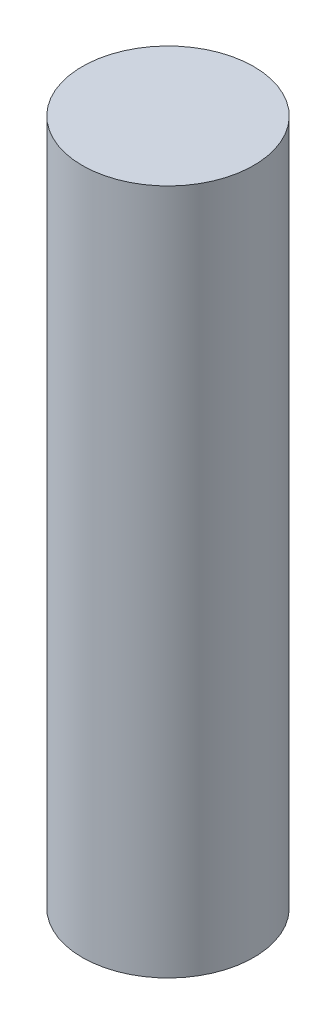
ISO-10303-21;
HEADER;
FILE_DESCRIPTION(('STEP AP214'),'2;1');
FILE_NAME('part.step','',(''),(''),'','','');
FILE_SCHEMA(('AUTOMOTIVE_DESIGN { 1 0 10303 214 1 1 1 1 }'));
ENDSEC;
DATA;
#1=APPLICATION_CONTEXT('core data for automotive mechanical design processes');
#2=APPLICATION_PROTOCOL_DEFINITION('international standard','automotive_design',2000,#1);
#3=PRODUCT_CONTEXT('',#1,'mechanical');
#4=PRODUCT('Part','Part','',(#3));
#5=PRODUCT_RELATED_PRODUCT_CATEGORY('part','',(#4));
#6=PRODUCT_DEFINITION_FORMATION('','',#4);
#7=PRODUCT_DEFINITION_CONTEXT('part definition',#1,'design');
#8=PRODUCT_DEFINITION('design','',#6,#7);
#9=PRODUCT_DEFINITION_SHAPE('','',#8);
#10=(LENGTH_UNIT() NAMED_UNIT(*) SI_UNIT(.MILLI.,.METRE.));
#11=(NAMED_UNIT(*) PLANE_ANGLE_UNIT() SI_UNIT($,.RADIAN.));
#12=(NAMED_UNIT(*) SI_UNIT($,.STERADIAN.) SOLID_ANGLE_UNIT());
#13=UNCERTAINTY_MEASURE_WITH_UNIT(LENGTH_MEASURE(1.E-05),#10,'distance_accuracy_value','');
#14=(GEOMETRIC_REPRESENTATION_CONTEXT(3) GLOBAL_UNCERTAINTY_ASSIGNED_CONTEXT((#13)) GLOBAL_UNIT_ASSIGNED_CONTEXT((#10,
#11,#12)) REPRESENTATION_CONTEXT('',''));
#15=CARTESIAN_POINT('',(0.,0.,0.));
#16=DIRECTION('',(0.,0.,1.));
#17=DIRECTION('',(1.,0.,0.));
#18=AXIS2_PLACEMENT_3D('',#15,#16,#17);
#19=CARTESIAN_POINT('',(0.,12.,0.));
#20=DIRECTION('',(0.,-1.,0.));
#21=DIRECTION('',(0.,0.,-1.));
#22=AXIS2_PLACEMENT_3D('',#19,#20,#21);
#23=CYLINDRICAL_SURFACE('',#22,1.5);
#24=CARTESIAN_POINT('',(0.,12.,0.));
#25=DIRECTION('',(0.,1.,0.));
#26=DIRECTION('',(0.,0.,1.));
#27=AXIS2_PLACEMENT_3D('',#24,#25,#26);
#28=CIRCLE('',#27,1.5);
#29=CARTESIAN_POINT('',(0.,12.,1.5));
#30=VERTEX_POINT('',#29);
#31=EDGE_CURVE('E10',#30,#30,#28,.T.);
#32=ORIENTED_EDGE('',*,*,#31,.F.);
#33=EDGE_LOOP('',(#32));
#34=FACE_BOUND('',#33,.T.);
#35=CARTESIAN_POINT('',(0.,0.,0.));
#36=DIRECTION('',(0.,1.,0.));
#37=DIRECTION('',(0.,0.,1.));
#38=AXIS2_PLACEMENT_3D('',#35,#36,#37);
#39=CIRCLE('',#38,1.5);
#40=CARTESIAN_POINT('',(0.,0.,1.5));
#41=VERTEX_POINT('',#40);
#42=EDGE_CURVE('E34',#41,#41,#39,.T.);
#43=ORIENTED_EDGE('',*,*,#42,.T.);
#44=EDGE_LOOP('',(#43));
#45=FACE_BOUND('',#44,.T.);
#46=ADVANCED_FACE('F31',(#34,#45),#23,.T.);
#47=CARTESIAN_POINT('',(0.,12.,0.));
#48=DIRECTION('',(0.,1.,0.));
#49=DIRECTION('',(0.,0.,1.));
#50=AXIS2_PLACEMENT_3D('',#47,#48,#49);
#51=PLANE('',#50);
#52=ORIENTED_EDGE('',*,*,#31,.T.);
#53=EDGE_LOOP('',(#52));
#54=FACE_BOUND('',#53,.T.);
#55=ADVANCED_FACE('F46',(#54),#51,.T.);
#56=CARTESIAN_POINT('',(0.,0.,0.));
#57=DIRECTION('',(0.,1.,0.));
#58=DIRECTION('',(0.,0.,1.));
#59=AXIS2_PLACEMENT_3D('',#56,#57,#58);
#60=PLANE('',#59);
#61=ORIENTED_EDGE('',*,*,#42,.F.);
#62=EDGE_LOOP('',(#61));
#63=FACE_BOUND('',#62,.T.);
#64=ADVANCED_FACE('F44',(#63),#60,.F.);
#65=CLOSED_SHELL('',(#46,#55,#64));
#66=MANIFOLD_SOLID_BREP('B2',#65);
#67=ADVANCED_BREP_SHAPE_REPRESENTATION('',(#18,#66),#14);
#68=SHAPE_DEFINITION_REPRESENTATION(#9,#67);
ENDSEC;
END-ISO-10303-21;
